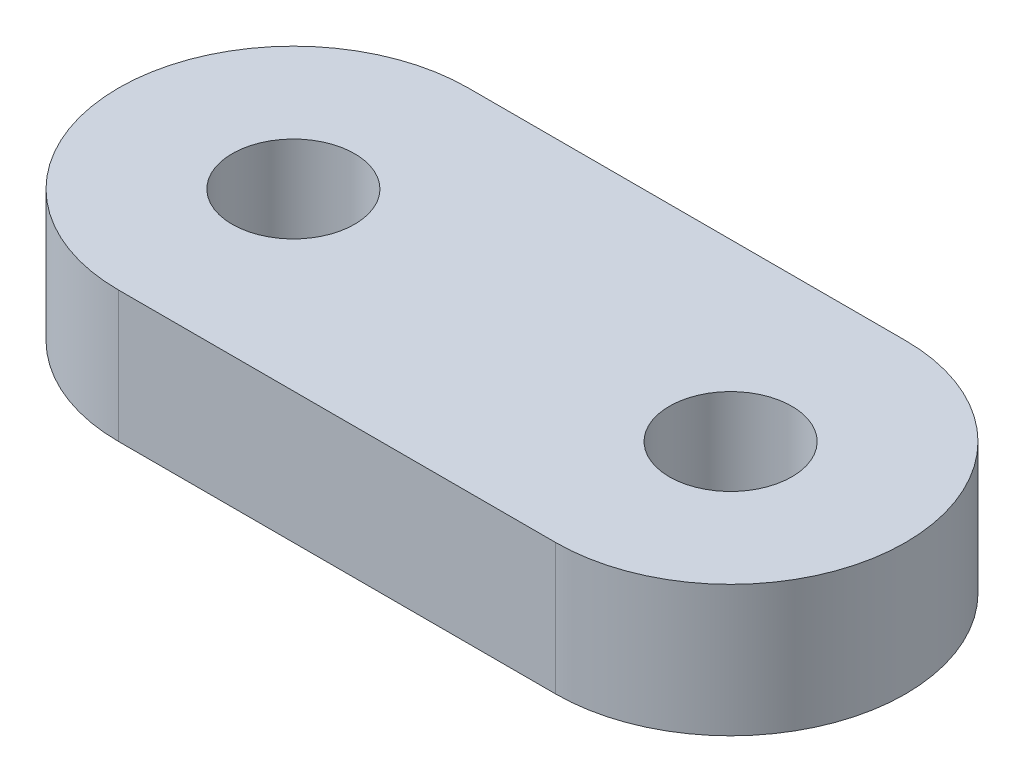
ISO-10303-21;
HEADER;
FILE_DESCRIPTION(('STEP AP214'),'2;1');
FILE_NAME('part.step','',(''),(''),'','','');
FILE_SCHEMA(('AUTOMOTIVE_DESIGN { 1 0 10303 214 1 1 1 1 }'));
ENDSEC;
DATA;
#1=APPLICATION_CONTEXT('core data for automotive mechanical design processes');
#2=APPLICATION_PROTOCOL_DEFINITION('international standard','automotive_design',2000,#1);
#3=PRODUCT_CONTEXT('',#1,'mechanical');
#4=PRODUCT('Part','Part','',(#3));
#5=PRODUCT_RELATED_PRODUCT_CATEGORY('part','',(#4));
#6=PRODUCT_DEFINITION_FORMATION('','',#4);
#7=PRODUCT_DEFINITION_CONTEXT('part definition',#1,'design');
#8=PRODUCT_DEFINITION('design','',#6,#7);
#9=PRODUCT_DEFINITION_SHAPE('','',#8);
#10=(LENGTH_UNIT() NAMED_UNIT(*) SI_UNIT(.MILLI.,.METRE.));
#11=(NAMED_UNIT(*) PLANE_ANGLE_UNIT() SI_UNIT($,.RADIAN.));
#12=(NAMED_UNIT(*) SI_UNIT($,.STERADIAN.) SOLID_ANGLE_UNIT());
#13=UNCERTAINTY_MEASURE_WITH_UNIT(LENGTH_MEASURE(1.E-05),#10,'distance_accuracy_value','');
#14=(GEOMETRIC_REPRESENTATION_CONTEXT(3) GLOBAL_UNCERTAINTY_ASSIGNED_CONTEXT((#13)) GLOBAL_UNIT_ASSIGNED_CONTEXT((#10,
#11,#12)) REPRESENTATION_CONTEXT('',''));
#15=CARTESIAN_POINT('',(0.,0.,0.));
#16=DIRECTION('',(0.,0.,1.));
#17=DIRECTION('',(1.,0.,0.));
#18=AXIS2_PLACEMENT_3D('',#15,#16,#17);
#19=CARTESIAN_POINT('',(4.9999998731266,3.,0.00112638091420356));
#20=DIRECTION('',(0.,1.,0.));
#21=DIRECTION('',(0.,0.,1.));
#22=AXIS2_PLACEMENT_3D('',#19,#20,#21);
#23=PLANE('',#22);
#24=CARTESIAN_POINT('',(4.9999998731266,3.,0.00112638091420356));
#25=DIRECTION('',(0.,1.,0.));
#26=DIRECTION('',(0.,0.,1.));
#27=AXIS2_PLACEMENT_3D('',#24,#25,#26);
#28=CIRCLE('',#27,1.4);
#29=CARTESIAN_POINT('',(4.9999998731266,3.,1.4011263809142));
#30=VERTEX_POINT('',#29);
#31=EDGE_CURVE('E118',#30,#30,#28,.T.);
#32=ORIENTED_EDGE('',*,*,#31,.F.);
#33=EDGE_LOOP('',(#32));
#34=FACE_BOUND('',#33,.T.);
#35=CARTESIAN_POINT('',(4.9999998731266,3.,0.00112638091420356));
#36=DIRECTION('',(0.,1.,0.));
#37=DIRECTION('',(0.,0.,1.));
#38=AXIS2_PLACEMENT_3D('',#35,#36,#37);
#39=CIRCLE('',#38,4.);
#40=CARTESIAN_POINT('',(4.99909876839524,3.,4.00112627941548));
#41=VERTEX_POINT('',#40);
#42=CARTESIAN_POINT('',(5.00090097785796,3.,-3.99887351758708));
#43=VERTEX_POINT('',#42);
#44=EDGE_CURVE('E98',#41,#43,#39,.T.);
#45=ORIENTED_EDGE('',*,*,#44,.T.);
#46=DIRECTION('',(-0.99999997462532,0.,-0.000225276182841058));
#47=VECTOR('',#46,1.);
#48=CARTESIAN_POINT('',(5.00090097785796,3.,-3.99887351758708));
#49=LINE('',#48,#47);
#50=CARTESIAN_POINT('',(-4.99909876839524,3.,-4.00112627941549));
#51=VERTEX_POINT('',#50);
#52=EDGE_CURVE('E93',#43,#51,#49,.T.);
#53=ORIENTED_EDGE('',*,*,#52,.T.);
#54=CARTESIAN_POINT('',(-4.9999998731266,3.,-0.00112638091420703));
#55=DIRECTION('',(0.,1.,0.));
#56=DIRECTION('',(0.,0.,1.));
#57=AXIS2_PLACEMENT_3D('',#54,#55,#56);
#58=CIRCLE('',#57,4.);
#59=CARTESIAN_POINT('',(-5.00090097785797,3.,3.99887351758707));
#60=VERTEX_POINT('',#59);
#61=EDGE_CURVE('E96',#51,#60,#58,.T.);
#62=ORIENTED_EDGE('',*,*,#61,.T.);
#63=DIRECTION('',(0.99999997462532,0.,0.000225276182841058));
#64=VECTOR('',#63,1.);
#65=CARTESIAN_POINT('',(-5.00090097785796,3.,3.99887351758707));
#66=LINE('',#65,#64);
#67=EDGE_CURVE('E63',#60,#41,#66,.T.);
#68=ORIENTED_EDGE('',*,*,#67,.T.);
#69=EDGE_LOOP('',(#45,#53,#62,#68));
#70=FACE_BOUND('',#69,.T.);
#71=CARTESIAN_POINT('',(-4.9999998731266,3.,-0.00112638091420703));
#72=DIRECTION('',(0.,1.,0.));
#73=DIRECTION('',(0.,0.,1.));
#74=AXIS2_PLACEMENT_3D('',#71,#72,#73);
#75=CIRCLE('',#74,1.4);
#76=CARTESIAN_POINT('',(-4.9999998731266,3.,1.39887361908579));
#77=VERTEX_POINT('',#76);
#78=EDGE_CURVE('E140',#77,#77,#75,.T.);
#79=ORIENTED_EDGE('',*,*,#78,.F.);
#80=EDGE_LOOP('',(#79));
#81=FACE_BOUND('',#80,.T.);
#82=ADVANCED_FACE('F45',(#34,#70,#81),#23,.T.);
#83=CARTESIAN_POINT('',(4.9999998731266,0.,0.00112638091420356));
#84=DIRECTION('',(0.,1.,0.));
#85=DIRECTION('',(0.,0.,1.));
#86=AXIS2_PLACEMENT_3D('',#83,#84,#85);
#87=PLANE('',#86);
#88=CARTESIAN_POINT('',(4.9999998731266,0.,0.00112638091420356));
#89=DIRECTION('',(0.,1.,0.));
#90=DIRECTION('',(0.,0.,1.));
#91=AXIS2_PLACEMENT_3D('',#88,#89,#90);
#92=CIRCLE('',#91,4.);
#93=CARTESIAN_POINT('',(4.99909876839524,0.,4.00112627941548));
#94=VERTEX_POINT('',#93);
#95=CARTESIAN_POINT('',(5.00090097785796,0.,-3.99887351758708));
#96=VERTEX_POINT('',#95);
#97=EDGE_CURVE('E114',#94,#96,#92,.T.);
#98=ORIENTED_EDGE('',*,*,#97,.F.);
#99=DIRECTION('',(0.99999997462532,0.,0.000225276182841058));
#100=VECTOR('',#99,1.);
#101=CARTESIAN_POINT('',(-5.00090097785796,0.,3.99887351758707));
#102=LINE('',#101,#100);
#103=CARTESIAN_POINT('',(-5.00090097785797,0.,3.99887351758707));
#104=VERTEX_POINT('',#103);
#105=EDGE_CURVE('E86',#104,#94,#102,.T.);
#106=ORIENTED_EDGE('',*,*,#105,.F.);
#107=CARTESIAN_POINT('',(-4.9999998731266,0.,-0.00112638091420703));
#108=DIRECTION('',(0.,1.,0.));
#109=DIRECTION('',(0.,0.,1.));
#110=AXIS2_PLACEMENT_3D('',#107,#108,#109);
#111=CIRCLE('',#110,4.);
#112=CARTESIAN_POINT('',(-4.99909876839524,0.,-4.00112627941549));
#113=VERTEX_POINT('',#112);
#114=EDGE_CURVE('E80',#113,#104,#111,.T.);
#115=ORIENTED_EDGE('',*,*,#114,.F.);
#116=DIRECTION('',(-0.99999997462532,0.,-0.000225276182841058));
#117=VECTOR('',#116,1.);
#118=CARTESIAN_POINT('',(5.00090097785796,0.,-3.99887351758708));
#119=LINE('',#118,#117);
#120=EDGE_CURVE('E103',#96,#113,#119,.T.);
#121=ORIENTED_EDGE('',*,*,#120,.F.);
#122=EDGE_LOOP('',(#98,#106,#115,#121));
#123=FACE_BOUND('',#122,.T.);
#124=CARTESIAN_POINT('',(4.9999998731266,0.,0.00112638091420356));
#125=DIRECTION('',(0.,1.,0.));
#126=DIRECTION('',(0.,0.,1.));
#127=AXIS2_PLACEMENT_3D('',#124,#125,#126);
#128=CIRCLE('',#127,1.4);
#129=CARTESIAN_POINT('',(4.9999998731266,0.,1.4011263809142));
#130=VERTEX_POINT('',#129);
#131=EDGE_CURVE('E136',#130,#130,#128,.T.);
#132=ORIENTED_EDGE('',*,*,#131,.T.);
#133=EDGE_LOOP('',(#132));
#134=FACE_BOUND('',#133,.T.);
#135=CARTESIAN_POINT('',(-4.9999998731266,0.,-0.00112638091420703));
#136=DIRECTION('',(0.,1.,0.));
#137=DIRECTION('',(0.,0.,1.));
#138=AXIS2_PLACEMENT_3D('',#135,#136,#137);
#139=CIRCLE('',#138,1.4);
#140=CARTESIAN_POINT('',(-4.9999998731266,0.,1.39887361908579));
#141=VERTEX_POINT('',#140);
#142=EDGE_CURVE('E144',#141,#141,#139,.T.);
#143=ORIENTED_EDGE('',*,*,#142,.T.);
#144=EDGE_LOOP('',(#143));
#145=FACE_BOUND('',#144,.T.);
#146=ADVANCED_FACE('F131',(#123,#134,#145),#87,.F.);
#147=CARTESIAN_POINT('',(4.9999998731266,3.,0.00112638091420356));
#148=DIRECTION('',(0.,-1.,0.));
#149=DIRECTION('',(0.,0.,-1.));
#150=AXIS2_PLACEMENT_3D('',#147,#148,#149);
#151=CYLINDRICAL_SURFACE('',#150,4.);
#152=ORIENTED_EDGE('',*,*,#97,.T.);
#153=DIRECTION('',(0.,-1.,0.));
#154=VECTOR('',#153,1.);
#155=CARTESIAN_POINT('',(5.00090097785796,3.,-3.99887351758708));
#156=LINE('',#155,#154);
#157=EDGE_CURVE('E11',#43,#96,#156,.T.);
#158=ORIENTED_EDGE('',*,*,#157,.F.);
#159=ORIENTED_EDGE('',*,*,#44,.F.);
#160=DIRECTION('',(0.,-1.,0.));
#161=VECTOR('',#160,1.);
#162=CARTESIAN_POINT('',(4.99909876839524,3.,4.00112627941548));
#163=LINE('',#162,#161);
#164=EDGE_CURVE('E110',#41,#94,#163,.T.);
#165=ORIENTED_EDGE('',*,*,#164,.T.);
#166=EDGE_LOOP('',(#152,#158,#159,#165));
#167=FACE_BOUND('',#166,.T.);
#168=ADVANCED_FACE('F47',(#167),#151,.T.);
#169=CARTESIAN_POINT('',(5.00090097785796,3.,-3.99887351758708));
#170=DIRECTION('',(-0.000225276182841058,0.,0.99999997462532));
#171=DIRECTION('',(0.999999974625321,0.,0.000225276182841058));
#172=AXIS2_PLACEMENT_3D('',#169,#170,#171);
#173=PLANE('',#172);
#174=ORIENTED_EDGE('',*,*,#120,.T.);
#175=DIRECTION('',(0.,-1.,0.));
#176=VECTOR('',#175,1.);
#177=CARTESIAN_POINT('',(-4.99909876839524,3.,-4.00112627941549));
#178=LINE('',#177,#176);
#179=EDGE_CURVE('E55',#51,#113,#178,.T.);
#180=ORIENTED_EDGE('',*,*,#179,.F.);
#181=ORIENTED_EDGE('',*,*,#52,.F.);
#182=ORIENTED_EDGE('',*,*,#157,.T.);
#183=EDGE_LOOP('',(#174,#180,#181,#182));
#184=FACE_BOUND('',#183,.T.);
#185=ADVANCED_FACE('F102',(#184),#173,.F.);
#186=CARTESIAN_POINT('',(-4.9999998731266,3.,-0.00112638091420703));
#187=DIRECTION('',(0.,-1.,0.));
#188=DIRECTION('',(0.,0.,-1.));
#189=AXIS2_PLACEMENT_3D('',#186,#187,#188);
#190=CYLINDRICAL_SURFACE('',#189,4.);
#191=ORIENTED_EDGE('',*,*,#114,.T.);
#192=DIRECTION('',(0.,-1.,0.));
#193=VECTOR('',#192,1.);
#194=CARTESIAN_POINT('',(-5.00090097785797,3.,3.99887351758707));
#195=LINE('',#194,#193);
#196=EDGE_CURVE('E105',#60,#104,#195,.T.);
#197=ORIENTED_EDGE('',*,*,#196,.F.);
#198=ORIENTED_EDGE('',*,*,#61,.F.);
#199=ORIENTED_EDGE('',*,*,#179,.T.);
#200=EDGE_LOOP('',(#191,#197,#198,#199));
#201=FACE_BOUND('',#200,.T.);
#202=ADVANCED_FACE('F106',(#201),#190,.T.);
#203=CARTESIAN_POINT('',(-5.00090097785796,3.,3.99887351758707));
#204=DIRECTION('',(0.000225276182841058,0.,-0.99999997462532));
#205=DIRECTION('',(-0.999999974625321,0.,-0.000225276182841058));
#206=AXIS2_PLACEMENT_3D('',#203,#204,#205);
#207=PLANE('',#206);
#208=ORIENTED_EDGE('',*,*,#105,.T.);
#209=ORIENTED_EDGE('',*,*,#164,.F.);
#210=ORIENTED_EDGE('',*,*,#67,.F.);
#211=ORIENTED_EDGE('',*,*,#196,.T.);
#212=EDGE_LOOP('',(#208,#209,#210,#211));
#213=FACE_BOUND('',#212,.T.);
#214=ADVANCED_FACE('F128',(#213),#207,.F.);
#215=CARTESIAN_POINT('',(4.9999998731266,3.,0.00112638091420356));
#216=DIRECTION('',(0.,-1.,0.));
#217=DIRECTION('',(0.,0.,-1.));
#218=AXIS2_PLACEMENT_3D('',#215,#216,#217);
#219=CYLINDRICAL_SURFACE('',#218,1.4);
#220=ORIENTED_EDGE('',*,*,#31,.T.);
#221=EDGE_LOOP('',(#220));
#222=FACE_BOUND('',#221,.T.);
#223=ORIENTED_EDGE('',*,*,#131,.F.);
#224=EDGE_LOOP('',(#223));
#225=FACE_BOUND('',#224,.T.);
#226=ADVANCED_FACE('F163',(#222,#225),#219,.F.);
#227=CARTESIAN_POINT('',(-4.9999998731266,3.,-0.00112638091420703));
#228=DIRECTION('',(0.,-1.,0.));
#229=DIRECTION('',(0.,0.,-1.));
#230=AXIS2_PLACEMENT_3D('',#227,#228,#229);
#231=CYLINDRICAL_SURFACE('',#230,1.4);
#232=ORIENTED_EDGE('',*,*,#78,.T.);
#233=EDGE_LOOP('',(#232));
#234=FACE_BOUND('',#233,.T.);
#235=ORIENTED_EDGE('',*,*,#142,.F.);
#236=EDGE_LOOP('',(#235));
#237=FACE_BOUND('',#236,.T.);
#238=ADVANCED_FACE('F152',(#234,#237),#231,.F.);
#239=CLOSED_SHELL('',(#82,#146,#168,#185,#202,#214,#226,#238));
#240=MANIFOLD_SOLID_BREP('B2',#239);
#241=ADVANCED_BREP_SHAPE_REPRESENTATION('',(#18,#240),#14);
#242=SHAPE_DEFINITION_REPRESENTATION(#9,#241);
ENDSEC;
END-ISO-10303-21;
